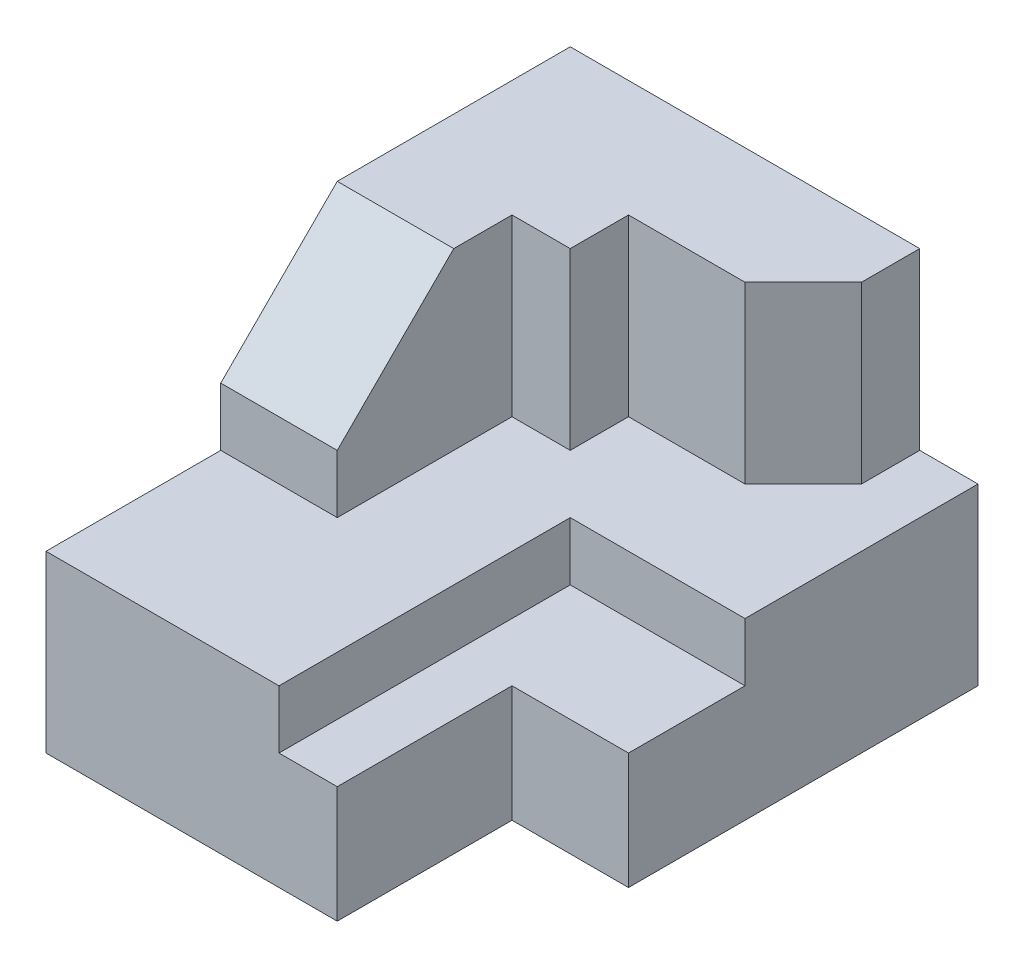
ISO-10303-21;
HEADER;
FILE_DESCRIPTION(('STEP AP214'),'2;1');
FILE_NAME('part.step','',(''),(''),'','','');
FILE_SCHEMA(('AUTOMOTIVE_DESIGN { 1 0 10303 214 1 1 1 1 }'));
ENDSEC;
DATA;
#1=APPLICATION_CONTEXT('core data for automotive mechanical design processes');
#2=APPLICATION_PROTOCOL_DEFINITION('international standard','automotive_design',2000,#1);
#3=PRODUCT_CONTEXT('',#1,'mechanical');
#4=PRODUCT('Part','Part','',(#3));
#5=PRODUCT_RELATED_PRODUCT_CATEGORY('part','',(#4));
#6=PRODUCT_DEFINITION_FORMATION('','',#4);
#7=PRODUCT_DEFINITION_CONTEXT('part definition',#1,'design');
#8=PRODUCT_DEFINITION('design','',#6,#7);
#9=PRODUCT_DEFINITION_SHAPE('','',#8);
#10=(LENGTH_UNIT() NAMED_UNIT(*) SI_UNIT(.MILLI.,.METRE.));
#11=(NAMED_UNIT(*) PLANE_ANGLE_UNIT() SI_UNIT($,.RADIAN.));
#12=(NAMED_UNIT(*) SI_UNIT($,.STERADIAN.) SOLID_ANGLE_UNIT());
#13=UNCERTAINTY_MEASURE_WITH_UNIT(LENGTH_MEASURE(1.E-05),#10,'distance_accuracy_value','');
#14=(GEOMETRIC_REPRESENTATION_CONTEXT(3) GLOBAL_UNCERTAINTY_ASSIGNED_CONTEXT((#13)) GLOBAL_UNIT_ASSIGNED_CONTEXT((#10,
#11,#12)) REPRESENTATION_CONTEXT('',''));
#15=CARTESIAN_POINT('',(0.,0.,0.));
#16=DIRECTION('',(0.,0.,1.));
#17=DIRECTION('',(1.,0.,0.));
#18=AXIS2_PLACEMENT_3D('',#15,#16,#17);
#19=CARTESIAN_POINT('',(-3.5,-3.,9.));
#20=DIRECTION('',(1.,0.,0.));
#21=DIRECTION('',(0.,0.,-1.));
#22=AXIS2_PLACEMENT_3D('',#19,#20,#21);
#23=PLANE('',#22);
#24=DIRECTION('',(0.,1.,0.));
#25=VECTOR('',#24,1.);
#26=CARTESIAN_POINT('',(-3.5,0.,6.));
#27=LINE('',#26,#25);
#28=CARTESIAN_POINT('',(-3.5,0.,6.));
#29=VERTEX_POINT('',#28);
#30=CARTESIAN_POINT('',(-3.5,1.,6.));
#31=VERTEX_POINT('',#30);
#32=EDGE_CURVE('E173',#29,#31,#27,.T.);
#33=ORIENTED_EDGE('',*,*,#32,.T.);
#34=DIRECTION('',(0.,0.707106781186548,-0.707106781186548));
#35=VECTOR('',#34,1.);
#36=CARTESIAN_POINT('',(-3.5,3.,4.));
#37=LINE('',#36,#35);
#38=CARTESIAN_POINT('',(-3.5,3.,4.));
#39=VERTEX_POINT('',#38);
#40=EDGE_CURVE('E48',#31,#39,#37,.T.);
#41=ORIENTED_EDGE('',*,*,#40,.T.);
#42=DIRECTION('',(0.,0.,-1.));
#43=VECTOR('',#42,1.);
#44=CARTESIAN_POINT('',(-3.5,3.,9.));
#45=LINE('',#44,#43);
#46=CARTESIAN_POINT('',(-3.5,3.,0.));
#47=VERTEX_POINT('',#46);
#48=EDGE_CURVE('E169',#39,#47,#45,.T.);
#49=ORIENTED_EDGE('',*,*,#48,.T.);
#50=DIRECTION('',(0.,-1.,0.));
#51=VECTOR('',#50,1.);
#52=CARTESIAN_POINT('',(-3.5,-3.,0.));
#53=LINE('',#52,#51);
#54=CARTESIAN_POINT('',(-3.5,-3.,0.));
#55=VERTEX_POINT('',#54);
#56=EDGE_CURVE('E202',#47,#55,#53,.T.);
#57=ORIENTED_EDGE('',*,*,#56,.T.);
#58=DIRECTION('',(0.,0.,-1.));
#59=VECTOR('',#58,1.);
#60=CARTESIAN_POINT('',(-3.5,-3.,9.));
#61=LINE('',#60,#59);
#62=CARTESIAN_POINT('',(-3.5,-3.,9.));
#63=VERTEX_POINT('',#62);
#64=EDGE_CURVE('E41',#63,#55,#61,.T.);
#65=ORIENTED_EDGE('',*,*,#64,.F.);
#66=DIRECTION('',(0.,-1.,0.));
#67=VECTOR('',#66,1.);
#68=CARTESIAN_POINT('',(-3.5,-3.,9.));
#69=LINE('',#68,#67);
#70=CARTESIAN_POINT('',(-3.5,0.,9.));
#71=VERTEX_POINT('',#70);
#72=EDGE_CURVE('E185',#71,#63,#69,.T.);
#73=ORIENTED_EDGE('',*,*,#72,.F.);
#74=DIRECTION('',(0.,0.,1.));
#75=VECTOR('',#74,1.);
#76=CARTESIAN_POINT('',(-3.5,0.,9.));
#77=LINE('',#76,#75);
#78=EDGE_CURVE('E204',#29,#71,#77,.T.);
#79=ORIENTED_EDGE('',*,*,#78,.F.);
#80=EDGE_LOOP('',(#33,#41,#49,#57,#65,#73,#79));
#81=FACE_BOUND('',#80,.T.);
#82=ADVANCED_FACE('F34',(#81),#23,.F.);
#83=CARTESIAN_POINT('',(3.5,-3.,9.));
#84=DIRECTION('',(-1.,0.,0.));
#85=DIRECTION('',(0.,0.,1.));
#86=AXIS2_PLACEMENT_3D('',#83,#84,#85);
#87=PLANE('',#86);
#88=DIRECTION('',(0.,0.,-1.));
#89=VECTOR('',#88,1.);
#90=CARTESIAN_POINT('',(3.5,-1.,9.));
#91=LINE('',#90,#89);
#92=CARTESIAN_POINT('',(3.5,-1.,6.));
#93=VERTEX_POINT('',#92);
#94=CARTESIAN_POINT('',(3.5,-1.,4.));
#95=VERTEX_POINT('',#94);
#96=EDGE_CURVE('E283',#93,#95,#91,.T.);
#97=ORIENTED_EDGE('',*,*,#96,.F.);
#98=DIRECTION('',(0.,1.,0.));
#99=VECTOR('',#98,1.);
#100=CARTESIAN_POINT('',(3.5,-3.,6.));
#101=LINE('',#100,#99);
#102=CARTESIAN_POINT('',(3.5,-3.,6.));
#103=VERTEX_POINT('',#102);
#104=EDGE_CURVE('E56',#103,#93,#101,.T.);
#105=ORIENTED_EDGE('',*,*,#104,.F.);
#106=DIRECTION('',(0.,0.,-1.));
#107=VECTOR('',#106,1.);
#108=CARTESIAN_POINT('',(3.5,-3.,9.));
#109=LINE('',#108,#107);
#110=CARTESIAN_POINT('',(3.5,-3.,0.));
#111=VERTEX_POINT('',#110);
#112=EDGE_CURVE('E180',#103,#111,#109,.T.);
#113=ORIENTED_EDGE('',*,*,#112,.T.);
#114=DIRECTION('',(0.,1.,0.));
#115=VECTOR('',#114,1.);
#116=CARTESIAN_POINT('',(3.5,-3.,0.));
#117=LINE('',#116,#115);
#118=CARTESIAN_POINT('',(3.5,0.,0.));
#119=VERTEX_POINT('',#118);
#120=EDGE_CURVE('E210',#111,#119,#117,.T.);
#121=ORIENTED_EDGE('',*,*,#120,.T.);
#122=DIRECTION('',(0.,0.,-1.));
#123=VECTOR('',#122,1.);
#124=CARTESIAN_POINT('',(3.5,0.,9.));
#125=LINE('',#124,#123);
#126=CARTESIAN_POINT('',(3.5,0.,4.));
#127=VERTEX_POINT('',#126);
#128=EDGE_CURVE('E218',#127,#119,#125,.T.);
#129=ORIENTED_EDGE('',*,*,#128,.F.);
#130=DIRECTION('',(0.,1.,0.));
#131=VECTOR('',#130,1.);
#132=CARTESIAN_POINT('',(3.5,-1.,4.));
#133=LINE('',#132,#131);
#134=EDGE_CURVE('E274',#95,#127,#133,.T.);
#135=ORIENTED_EDGE('',*,*,#134,.F.);
#136=EDGE_LOOP('',(#97,#105,#113,#121,#129,#135));
#137=FACE_BOUND('',#136,.T.);
#138=ADVANCED_FACE('F344',(#137),#87,.F.);
#139=CARTESIAN_POINT('',(3.5,3.,9.));
#140=DIRECTION('',(0.,-1.,0.));
#141=DIRECTION('',(1.,0.,0.));
#142=AXIS2_PLACEMENT_3D('',#139,#140,#141);
#143=PLANE('',#142);
#144=ORIENTED_EDGE('',*,*,#48,.F.);
#145=DIRECTION('',(1.,0.,0.));
#146=VECTOR('',#145,1.);
#147=CARTESIAN_POINT('',(-3.5,3.,4.));
#148=LINE('',#147,#146);
#149=CARTESIAN_POINT('',(-1.5,3.,4.));
#150=VERTEX_POINT('',#149);
#151=EDGE_CURVE('E157',#39,#150,#148,.T.);
#152=ORIENTED_EDGE('',*,*,#151,.T.);
#153=DIRECTION('',(0.,0.,-1.));
#154=VECTOR('',#153,1.);
#155=CARTESIAN_POINT('',(-1.5,3.,3.));
#156=LINE('',#155,#154);
#157=CARTESIAN_POINT('',(-1.5,3.,3.));
#158=VERTEX_POINT('',#157);
#159=EDGE_CURVE('E253',#150,#158,#156,.T.);
#160=ORIENTED_EDGE('',*,*,#159,.T.);
#161=DIRECTION('',(1.,0.,0.));
#162=VECTOR('',#161,1.);
#163=CARTESIAN_POINT('',(-0.5,3.,3.));
#164=LINE('',#163,#162);
#165=CARTESIAN_POINT('',(-0.5,3.,3.));
#166=VERTEX_POINT('',#165);
#167=EDGE_CURVE('E250',#158,#166,#164,.T.);
#168=ORIENTED_EDGE('',*,*,#167,.T.);
#169=DIRECTION('',(0.,0.,-1.));
#170=VECTOR('',#169,1.);
#171=CARTESIAN_POINT('',(-0.500000000000001,3.,2.));
#172=LINE('',#171,#170);
#173=CARTESIAN_POINT('',(-0.500000000000001,3.,2.));
#174=VERTEX_POINT('',#173);
#175=EDGE_CURVE('E247',#166,#174,#172,.T.);
#176=ORIENTED_EDGE('',*,*,#175,.T.);
#177=DIRECTION('',(1.,0.,0.));
#178=VECTOR('',#177,1.);
#179=CARTESIAN_POINT('',(1.5,3.,2.));
#180=LINE('',#179,#178);
#181=CARTESIAN_POINT('',(1.5,3.,2.));
#182=VERTEX_POINT('',#181);
#183=EDGE_CURVE('E244',#174,#182,#180,.T.);
#184=ORIENTED_EDGE('',*,*,#183,.T.);
#185=DIRECTION('',(0.707106781186548,0.,-0.707106781186547));
#186=VECTOR('',#185,1.);
#187=CARTESIAN_POINT('',(2.5,3.,1.));
#188=LINE('',#187,#186);
#189=CARTESIAN_POINT('',(2.5,3.,1.));
#190=VERTEX_POINT('',#189);
#191=EDGE_CURVE('E241',#182,#190,#188,.T.);
#192=ORIENTED_EDGE('',*,*,#191,.T.);
#193=DIRECTION('',(0.,0.,-1.));
#194=VECTOR('',#193,1.);
#195=CARTESIAN_POINT('',(2.5,3.,0.));
#196=LINE('',#195,#194);
#197=CARTESIAN_POINT('',(2.5,3.,0.));
#198=VERTEX_POINT('',#197);
#199=EDGE_CURVE('E238',#190,#198,#196,.T.);
#200=ORIENTED_EDGE('',*,*,#199,.T.);
#201=DIRECTION('',(-1.,0.,0.));
#202=VECTOR('',#201,1.);
#203=CARTESIAN_POINT('',(3.5,3.,0.));
#204=LINE('',#203,#202);
#205=EDGE_CURVE('E178',#198,#47,#204,.T.);
#206=ORIENTED_EDGE('',*,*,#205,.T.);
#207=EDGE_LOOP('',(#144,#152,#160,#168,#176,#184,#192,#200,#206));
#208=FACE_BOUND('',#207,.T.);
#209=ADVANCED_FACE('F175',(#208),#143,.F.);
#210=CARTESIAN_POINT('',(0.,0.,9.));
#211=DIRECTION('',(0.,0.,1.));
#212=DIRECTION('',(1.,0.,0.));
#213=AXIS2_PLACEMENT_3D('',#210,#211,#212);
#214=PLANE('',#213);
#215=DIRECTION('',(0.,1.,0.));
#216=VECTOR('',#215,1.);
#217=CARTESIAN_POINT('',(1.5,-3.,9.));
#218=LINE('',#217,#216);
#219=CARTESIAN_POINT('',(1.5,-3.,9.));
#220=VERTEX_POINT('',#219);
#221=CARTESIAN_POINT('',(1.5,-1.,9.));
#222=VERTEX_POINT('',#221);
#223=EDGE_CURVE('E287',#220,#222,#218,.T.);
#224=ORIENTED_EDGE('',*,*,#223,.T.);
#225=DIRECTION('',(1.,0.,0.));
#226=VECTOR('',#225,1.);
#227=CARTESIAN_POINT('',(0.500000000000001,-1.,9.));
#228=LINE('',#227,#226);
#229=CARTESIAN_POINT('',(0.500000000000001,-1.,9.));
#230=VERTEX_POINT('',#229);
#231=EDGE_CURVE('E277',#230,#222,#228,.T.);
#232=ORIENTED_EDGE('',*,*,#231,.F.);
#233=DIRECTION('',(0.,1.,0.));
#234=VECTOR('',#233,1.);
#235=CARTESIAN_POINT('',(0.500000000000001,-1.,9.));
#236=LINE('',#235,#234);
#237=CARTESIAN_POINT('',(0.5,0.,9.));
#238=VERTEX_POINT('',#237);
#239=EDGE_CURVE('E255',#230,#238,#236,.T.);
#240=ORIENTED_EDGE('',*,*,#239,.T.);
#241=DIRECTION('',(-1.,0.,0.));
#242=VECTOR('',#241,1.);
#243=CARTESIAN_POINT('',(0.,0.,9.));
#244=LINE('',#243,#242);
#245=EDGE_CURVE('E216',#238,#71,#244,.T.);
#246=ORIENTED_EDGE('',*,*,#245,.T.);
#247=ORIENTED_EDGE('',*,*,#72,.T.);
#248=DIRECTION('',(1.,0.,0.));
#249=VECTOR('',#248,1.);
#250=CARTESIAN_POINT('',(3.5,-3.,9.));
#251=LINE('',#250,#249);
#252=EDGE_CURVE('E181',#63,#220,#251,.T.);
#253=ORIENTED_EDGE('',*,*,#252,.T.);
#254=EDGE_LOOP('',(#224,#232,#240,#246,#247,#253));
#255=FACE_BOUND('',#254,.T.);
#256=ADVANCED_FACE('F352',(#255),#214,.T.);
#257=CARTESIAN_POINT('',(3.5,-3.,9.));
#258=DIRECTION('',(0.,1.,0.));
#259=DIRECTION('',(-1.,0.,0.));
#260=AXIS2_PLACEMENT_3D('',#257,#258,#259);
#261=PLANE('',#260);
#262=DIRECTION('',(-1.,0.,0.));
#263=VECTOR('',#262,1.);
#264=CARTESIAN_POINT('',(3.5,-3.,6.));
#265=LINE('',#264,#263);
#266=CARTESIAN_POINT('',(1.5,-3.,6.));
#267=VERTEX_POINT('',#266);
#268=EDGE_CURVE('E305',#103,#267,#265,.T.);
#269=ORIENTED_EDGE('',*,*,#268,.T.);
#270=DIRECTION('',(0.,0.,1.));
#271=VECTOR('',#270,1.);
#272=CARTESIAN_POINT('',(1.5,-3.,6.));
#273=LINE('',#272,#271);
#274=EDGE_CURVE('E299',#267,#220,#273,.T.);
#275=ORIENTED_EDGE('',*,*,#274,.T.);
#276=ORIENTED_EDGE('',*,*,#252,.F.);
#277=ORIENTED_EDGE('',*,*,#64,.T.);
#278=DIRECTION('',(1.,0.,0.));
#279=VECTOR('',#278,1.);
#280=CARTESIAN_POINT('',(3.5,-3.,0.));
#281=LINE('',#280,#279);
#282=EDGE_CURVE('E198',#55,#111,#281,.T.);
#283=ORIENTED_EDGE('',*,*,#282,.T.);
#284=ORIENTED_EDGE('',*,*,#112,.F.);
#285=EDGE_LOOP('',(#269,#275,#276,#277,#283,#284));
#286=FACE_BOUND('',#285,.T.);
#287=ADVANCED_FACE('F195',(#286),#261,.F.);
#288=CARTESIAN_POINT('',(0.,0.,0.));
#289=DIRECTION('',(0.,0.,1.));
#290=DIRECTION('',(1.,0.,0.));
#291=AXIS2_PLACEMENT_3D('',#288,#289,#290);
#292=PLANE('',#291);
#293=DIRECTION('',(0.,1.,0.));
#294=VECTOR('',#293,1.);
#295=CARTESIAN_POINT('',(2.5,0.,0.));
#296=LINE('',#295,#294);
#297=CARTESIAN_POINT('',(2.5,0.,0.));
#298=VERTEX_POINT('',#297);
#299=EDGE_CURVE('E220',#298,#198,#296,.T.);
#300=ORIENTED_EDGE('',*,*,#299,.F.);
#301=DIRECTION('',(-1.,0.,0.));
#302=VECTOR('',#301,1.);
#303=CARTESIAN_POINT('',(0.,0.,0.));
#304=LINE('',#303,#302);
#305=EDGE_CURVE('E12',#119,#298,#304,.T.);
#306=ORIENTED_EDGE('',*,*,#305,.F.);
#307=ORIENTED_EDGE('',*,*,#120,.F.);
#308=ORIENTED_EDGE('',*,*,#282,.F.);
#309=ORIENTED_EDGE('',*,*,#56,.F.);
#310=ORIENTED_EDGE('',*,*,#205,.F.);
#311=EDGE_LOOP('',(#300,#306,#307,#308,#309,#310));
#312=FACE_BOUND('',#311,.T.);
#313=ADVANCED_FACE('F207',(#312),#292,.F.);
#314=CARTESIAN_POINT('',(0.,0.,4.5));
#315=DIRECTION('',(0.,1.,0.));
#316=DIRECTION('',(-1.,0.,0.));
#317=AXIS2_PLACEMENT_3D('',#314,#315,#316);
#318=PLANE('',#317);
#319=DIRECTION('',(0.,0.,1.));
#320=VECTOR('',#319,1.);
#321=CARTESIAN_POINT('',(0.5,0.,4.));
#322=LINE('',#321,#320);
#323=CARTESIAN_POINT('',(0.5,0.,4.));
#324=VERTEX_POINT('',#323);
#325=EDGE_CURVE('E281',#324,#238,#322,.T.);
#326=ORIENTED_EDGE('',*,*,#325,.F.);
#327=DIRECTION('',(-1.,0.,0.));
#328=VECTOR('',#327,1.);
#329=CARTESIAN_POINT('',(3.5,0.,4.));
#330=LINE('',#329,#328);
#331=EDGE_CURVE('E284',#127,#324,#330,.T.);
#332=ORIENTED_EDGE('',*,*,#331,.F.);
#333=ORIENTED_EDGE('',*,*,#128,.T.);
#334=ORIENTED_EDGE('',*,*,#305,.T.);
#335=DIRECTION('',(0.,0.,-1.));
#336=VECTOR('',#335,1.);
#337=CARTESIAN_POINT('',(2.5,0.,0.));
#338=LINE('',#337,#336);
#339=CARTESIAN_POINT('',(2.5,0.,1.));
#340=VERTEX_POINT('',#339);
#341=EDGE_CURVE('E223',#340,#298,#338,.T.);
#342=ORIENTED_EDGE('',*,*,#341,.F.);
#343=DIRECTION('',(0.707106781186548,0.,-0.707106781186547));
#344=VECTOR('',#343,1.);
#345=CARTESIAN_POINT('',(2.5,0.,1.));
#346=LINE('',#345,#344);
#347=CARTESIAN_POINT('',(1.5,0.,2.));
#348=VERTEX_POINT('',#347);
#349=EDGE_CURVE('E257',#348,#340,#346,.T.);
#350=ORIENTED_EDGE('',*,*,#349,.F.);
#351=DIRECTION('',(1.,0.,0.));
#352=VECTOR('',#351,1.);
#353=CARTESIAN_POINT('',(1.5,0.,2.));
#354=LINE('',#353,#352);
#355=CARTESIAN_POINT('',(-0.5,0.,2.));
#356=VERTEX_POINT('',#355);
#357=EDGE_CURVE('E260',#356,#348,#354,.T.);
#358=ORIENTED_EDGE('',*,*,#357,.F.);
#359=DIRECTION('',(0.,0.,-1.));
#360=VECTOR('',#359,1.);
#361=CARTESIAN_POINT('',(-0.5,0.,2.));
#362=LINE('',#361,#360);
#363=CARTESIAN_POINT('',(-0.5,0.,3.));
#364=VERTEX_POINT('',#363);
#365=EDGE_CURVE('E263',#364,#356,#362,.T.);
#366=ORIENTED_EDGE('',*,*,#365,.F.);
#367=DIRECTION('',(1.,0.,0.));
#368=VECTOR('',#367,1.);
#369=CARTESIAN_POINT('',(-0.5,0.,3.));
#370=LINE('',#369,#368);
#371=CARTESIAN_POINT('',(-1.5,0.,3.));
#372=VERTEX_POINT('',#371);
#373=EDGE_CURVE('E266',#372,#364,#370,.T.);
#374=ORIENTED_EDGE('',*,*,#373,.F.);
#375=DIRECTION('',(0.,0.,-1.));
#376=VECTOR('',#375,1.);
#377=CARTESIAN_POINT('',(-1.5,0.,3.));
#378=LINE('',#377,#376);
#379=CARTESIAN_POINT('',(-1.5,0.,6.));
#380=VERTEX_POINT('',#379);
#381=EDGE_CURVE('E269',#380,#372,#378,.T.);
#382=ORIENTED_EDGE('',*,*,#381,.F.);
#383=DIRECTION('',(1.,0.,0.));
#384=VECTOR('',#383,1.);
#385=CARTESIAN_POINT('',(-1.5,0.,6.));
#386=LINE('',#385,#384);
#387=EDGE_CURVE('E240',#29,#380,#386,.T.);
#388=ORIENTED_EDGE('',*,*,#387,.F.);
#389=ORIENTED_EDGE('',*,*,#78,.T.);
#390=ORIENTED_EDGE('',*,*,#245,.F.);
#391=EDGE_LOOP('',(#326,#332,#333,#334,#342,#350,#358,#366,#374,#382,#388,#389,#390));
#392=FACE_BOUND('',#391,.T.);
#393=ADVANCED_FACE('F317',(#392),#318,.T.);
#394=CARTESIAN_POINT('',(2.5,0.,0.));
#395=DIRECTION('',(1.,0.,0.));
#396=DIRECTION('',(0.,1.,0.));
#397=AXIS2_PLACEMENT_3D('',#394,#395,#396);
#398=PLANE('',#397);
#399=ORIENTED_EDGE('',*,*,#199,.F.);
#400=DIRECTION('',(0.,1.,0.));
#401=VECTOR('',#400,1.);
#402=CARTESIAN_POINT('',(2.5,0.,1.));
#403=LINE('',#402,#401);
#404=EDGE_CURVE('E235',#340,#190,#403,.T.);
#405=ORIENTED_EDGE('',*,*,#404,.F.);
#406=ORIENTED_EDGE('',*,*,#341,.T.);
#407=ORIENTED_EDGE('',*,*,#299,.T.);
#408=EDGE_LOOP('',(#399,#405,#406,#407));
#409=FACE_BOUND('',#408,.T.);
#410=ADVANCED_FACE('F337',(#409),#398,.T.);
#411=CARTESIAN_POINT('',(2.5,0.,1.));
#412=DIRECTION('',(0.707106781186547,0.,0.707106781186548));
#413=DIRECTION('',(0.707106781186548,0.,-0.707106781186547));
#414=AXIS2_PLACEMENT_3D('',#411,#412,#413);
#415=PLANE('',#414);
#416=ORIENTED_EDGE('',*,*,#191,.F.);
#417=DIRECTION('',(0.,1.,0.));
#418=VECTOR('',#417,1.);
#419=CARTESIAN_POINT('',(1.5,0.,2.));
#420=LINE('',#419,#418);
#421=EDGE_CURVE('E233',#348,#182,#420,.T.);
#422=ORIENTED_EDGE('',*,*,#421,.F.);
#423=ORIENTED_EDGE('',*,*,#349,.T.);
#424=ORIENTED_EDGE('',*,*,#404,.T.);
#425=EDGE_LOOP('',(#416,#422,#423,#424));
#426=FACE_BOUND('',#425,.T.);
#427=ADVANCED_FACE('F334',(#426),#415,.T.);
#428=CARTESIAN_POINT('',(1.5,0.,2.));
#429=DIRECTION('',(0.,0.,1.));
#430=DIRECTION('',(1.,0.,0.));
#431=AXIS2_PLACEMENT_3D('',#428,#429,#430);
#432=PLANE('',#431);
#433=ORIENTED_EDGE('',*,*,#183,.F.);
#434=DIRECTION('',(0.,1.,0.));
#435=VECTOR('',#434,1.);
#436=CARTESIAN_POINT('',(-0.5,0.,2.));
#437=LINE('',#436,#435);
#438=EDGE_CURVE('E231',#356,#174,#437,.T.);
#439=ORIENTED_EDGE('',*,*,#438,.F.);
#440=ORIENTED_EDGE('',*,*,#357,.T.);
#441=ORIENTED_EDGE('',*,*,#421,.T.);
#442=EDGE_LOOP('',(#433,#439,#440,#441));
#443=FACE_BOUND('',#442,.T.);
#444=ADVANCED_FACE('F330',(#443),#432,.T.);
#445=CARTESIAN_POINT('',(-0.5,0.,2.));
#446=DIRECTION('',(1.,0.,0.));
#447=DIRECTION('',(0.,0.,-1.));
#448=AXIS2_PLACEMENT_3D('',#445,#446,#447);
#449=PLANE('',#448);
#450=ORIENTED_EDGE('',*,*,#175,.F.);
#451=DIRECTION('',(0.,1.,0.));
#452=VECTOR('',#451,1.);
#453=CARTESIAN_POINT('',(-0.5,0.,3.));
#454=LINE('',#453,#452);
#455=EDGE_CURVE('E229',#364,#166,#454,.T.);
#456=ORIENTED_EDGE('',*,*,#455,.F.);
#457=ORIENTED_EDGE('',*,*,#365,.T.);
#458=ORIENTED_EDGE('',*,*,#438,.T.);
#459=EDGE_LOOP('',(#450,#456,#457,#458));
#460=FACE_BOUND('',#459,.T.);
#461=ADVANCED_FACE('F327',(#460),#449,.T.);
#462=CARTESIAN_POINT('',(-0.5,0.,3.));
#463=DIRECTION('',(0.,0.,1.));
#464=DIRECTION('',(1.,0.,0.));
#465=AXIS2_PLACEMENT_3D('',#462,#463,#464);
#466=PLANE('',#465);
#467=ORIENTED_EDGE('',*,*,#167,.F.);
#468=DIRECTION('',(0.,1.,0.));
#469=VECTOR('',#468,1.);
#470=CARTESIAN_POINT('',(-1.5,0.,3.));
#471=LINE('',#470,#469);
#472=EDGE_CURVE('E226',#372,#158,#471,.T.);
#473=ORIENTED_EDGE('',*,*,#472,.F.);
#474=ORIENTED_EDGE('',*,*,#373,.T.);
#475=ORIENTED_EDGE('',*,*,#455,.T.);
#476=EDGE_LOOP('',(#467,#473,#474,#475));
#477=FACE_BOUND('',#476,.T.);
#478=ADVANCED_FACE('F323',(#477),#466,.T.);
#479=CARTESIAN_POINT('',(-1.5,0.,3.));
#480=DIRECTION('',(1.,0.,0.));
#481=DIRECTION('',(0.,0.,-1.));
#482=AXIS2_PLACEMENT_3D('',#479,#480,#481);
#483=PLANE('',#482);
#484=DIRECTION('',(0.,0.707106781186548,-0.707106781186548));
#485=VECTOR('',#484,1.);
#486=CARTESIAN_POINT('',(-1.5,3.,4.));
#487=LINE('',#486,#485);
#488=CARTESIAN_POINT('',(-1.5,1.,6.));
#489=VERTEX_POINT('',#488);
#490=EDGE_CURVE('E160',#489,#150,#487,.T.);
#491=ORIENTED_EDGE('',*,*,#490,.F.);
#492=DIRECTION('',(0.,1.,0.));
#493=VECTOR('',#492,1.);
#494=CARTESIAN_POINT('',(-1.5,0.,6.));
#495=LINE('',#494,#493);
#496=EDGE_CURVE('E222',#380,#489,#495,.T.);
#497=ORIENTED_EDGE('',*,*,#496,.F.);
#498=ORIENTED_EDGE('',*,*,#381,.T.);
#499=ORIENTED_EDGE('',*,*,#472,.T.);
#500=ORIENTED_EDGE('',*,*,#159,.F.);
#501=EDGE_LOOP('',(#491,#497,#498,#499,#500));
#502=FACE_BOUND('',#501,.T.);
#503=ADVANCED_FACE('F312',(#502),#483,.T.);
#504=CARTESIAN_POINT('',(-1.5,0.,6.));
#505=DIRECTION('',(0.,0.,1.));
#506=DIRECTION('',(1.,0.,0.));
#507=AXIS2_PLACEMENT_3D('',#504,#505,#506);
#508=PLANE('',#507);
#509=DIRECTION('',(1.,0.,0.));
#510=VECTOR('',#509,1.);
#511=CARTESIAN_POINT('',(-3.5,1.,6.));
#512=LINE('',#511,#510);
#513=EDGE_CURVE('E165',#31,#489,#512,.T.);
#514=ORIENTED_EDGE('',*,*,#513,.F.);
#515=ORIENTED_EDGE('',*,*,#32,.F.);
#516=ORIENTED_EDGE('',*,*,#387,.T.);
#517=ORIENTED_EDGE('',*,*,#496,.T.);
#518=EDGE_LOOP('',(#514,#515,#516,#517));
#519=FACE_BOUND('',#518,.T.);
#520=ADVANCED_FACE('F314',(#519),#508,.T.);
#521=CARTESIAN_POINT('',(0.5,-1.,4.));
#522=DIRECTION('',(-1.,0.,0.));
#523=DIRECTION('',(0.,-1.,0.));
#524=AXIS2_PLACEMENT_3D('',#521,#522,#523);
#525=PLANE('',#524);
#526=ORIENTED_EDGE('',*,*,#325,.T.);
#527=ORIENTED_EDGE('',*,*,#239,.F.);
#528=DIRECTION('',(0.,0.,1.));
#529=VECTOR('',#528,1.);
#530=CARTESIAN_POINT('',(0.5,-1.,4.));
#531=LINE('',#530,#529);
#532=CARTESIAN_POINT('',(0.5,-1.,4.));
#533=VERTEX_POINT('',#532);
#534=EDGE_CURVE('E290',#533,#230,#531,.T.);
#535=ORIENTED_EDGE('',*,*,#534,.F.);
#536=DIRECTION('',(0.,1.,0.));
#537=VECTOR('',#536,1.);
#538=CARTESIAN_POINT('',(0.5,-1.,4.));
#539=LINE('',#538,#537);
#540=EDGE_CURVE('E276',#533,#324,#539,.T.);
#541=ORIENTED_EDGE('',*,*,#540,.T.);
#542=EDGE_LOOP('',(#526,#527,#535,#541));
#543=FACE_BOUND('',#542,.T.);
#544=ADVANCED_FACE('F358',(#543),#525,.F.);
#545=CARTESIAN_POINT('',(3.5,-1.,4.));
#546=DIRECTION('',(0.,0.,-1.));
#547=DIRECTION('',(-1.,0.,0.));
#548=AXIS2_PLACEMENT_3D('',#545,#546,#547);
#549=PLANE('',#548);
#550=ORIENTED_EDGE('',*,*,#331,.T.);
#551=ORIENTED_EDGE('',*,*,#540,.F.);
#552=DIRECTION('',(-1.,0.,0.));
#553=VECTOR('',#552,1.);
#554=CARTESIAN_POINT('',(3.5,-1.,4.));
#555=LINE('',#554,#553);
#556=EDGE_CURVE('E293',#95,#533,#555,.T.);
#557=ORIENTED_EDGE('',*,*,#556,.F.);
#558=ORIENTED_EDGE('',*,*,#134,.T.);
#559=EDGE_LOOP('',(#550,#551,#557,#558));
#560=FACE_BOUND('',#559,.T.);
#561=ADVANCED_FACE('F360',(#560),#549,.F.);
#562=CARTESIAN_POINT('',(0.,-1.,0.));
#563=DIRECTION('',(0.,1.,0.));
#564=DIRECTION('',(-1.,0.,0.));
#565=AXIS2_PLACEMENT_3D('',#562,#563,#564);
#566=PLANE('',#565);
#567=DIRECTION('',(0.,0.,1.));
#568=VECTOR('',#567,1.);
#569=CARTESIAN_POINT('',(1.5,-1.,6.));
#570=LINE('',#569,#568);
#571=CARTESIAN_POINT('',(1.5,-1.,6.));
#572=VERTEX_POINT('',#571);
#573=EDGE_CURVE('E303',#572,#222,#570,.T.);
#574=ORIENTED_EDGE('',*,*,#573,.F.);
#575=DIRECTION('',(-1.,0.,0.));
#576=VECTOR('',#575,1.);
#577=CARTESIAN_POINT('',(3.5,-1.,6.));
#578=LINE('',#577,#576);
#579=EDGE_CURVE('E164',#93,#572,#578,.T.);
#580=ORIENTED_EDGE('',*,*,#579,.F.);
#581=ORIENTED_EDGE('',*,*,#96,.T.);
#582=ORIENTED_EDGE('',*,*,#556,.T.);
#583=ORIENTED_EDGE('',*,*,#534,.T.);
#584=ORIENTED_EDGE('',*,*,#231,.T.);
#585=EDGE_LOOP('',(#574,#580,#581,#582,#583,#584));
#586=FACE_BOUND('',#585,.T.);
#587=ADVANCED_FACE('F354',(#586),#566,.T.);
#588=CARTESIAN_POINT('',(1.5,-3.,6.));
#589=DIRECTION('',(-1.,0.,0.));
#590=DIRECTION('',(0.,-1.,0.));
#591=AXIS2_PLACEMENT_3D('',#588,#589,#590);
#592=PLANE('',#591);
#593=ORIENTED_EDGE('',*,*,#573,.T.);
#594=ORIENTED_EDGE('',*,*,#223,.F.);
#595=ORIENTED_EDGE('',*,*,#274,.F.);
#596=DIRECTION('',(0.,1.,0.));
#597=VECTOR('',#596,1.);
#598=CARTESIAN_POINT('',(1.5,-3.,6.));
#599=LINE('',#598,#597);
#600=EDGE_CURVE('E298',#267,#572,#599,.T.);
#601=ORIENTED_EDGE('',*,*,#600,.T.);
#602=EDGE_LOOP('',(#593,#594,#595,#601));
#603=FACE_BOUND('',#602,.T.);
#604=ADVANCED_FACE('F349',(#603),#592,.F.);
#605=CARTESIAN_POINT('',(3.5,-3.,6.));
#606=DIRECTION('',(0.,0.,-1.));
#607=DIRECTION('',(-1.,0.,0.));
#608=AXIS2_PLACEMENT_3D('',#605,#606,#607);
#609=PLANE('',#608);
#610=ORIENTED_EDGE('',*,*,#579,.T.);
#611=ORIENTED_EDGE('',*,*,#600,.F.);
#612=ORIENTED_EDGE('',*,*,#268,.F.);
#613=ORIENTED_EDGE('',*,*,#104,.T.);
#614=EDGE_LOOP('',(#610,#611,#612,#613));
#615=FACE_BOUND('',#614,.T.);
#616=ADVANCED_FACE('F346',(#615),#609,.F.);
#617=CARTESIAN_POINT('',(-3.5,3.,4.));
#618=DIRECTION('',(0.,-0.707106781186547,-0.707106781186547));
#619=DIRECTION('',(0.,0.707106781186548,-0.707106781186548));
#620=AXIS2_PLACEMENT_3D('',#617,#618,#619);
#621=PLANE('',#620);
#622=ORIENTED_EDGE('',*,*,#490,.T.);
#623=ORIENTED_EDGE('',*,*,#151,.F.);
#624=ORIENTED_EDGE('',*,*,#40,.F.);
#625=ORIENTED_EDGE('',*,*,#513,.T.);
#626=EDGE_LOOP('',(#622,#623,#624,#625));
#627=FACE_BOUND('',#626,.T.);
#628=ADVANCED_FACE('F158',(#627),#621,.F.);
#629=CLOSED_SHELL('',(#82,#138,#209,#256,#287,#313,#393,#410,#427,#444,#461,#478,#503,#520,#544,
#561,#587,#604,#616,#628));
#630=MANIFOLD_SOLID_BREP('B2',#629);
#631=ADVANCED_BREP_SHAPE_REPRESENTATION('',(#18,#630),#14);
#632=SHAPE_DEFINITION_REPRESENTATION(#9,#631);
ENDSEC;
END-ISO-10303-21;
